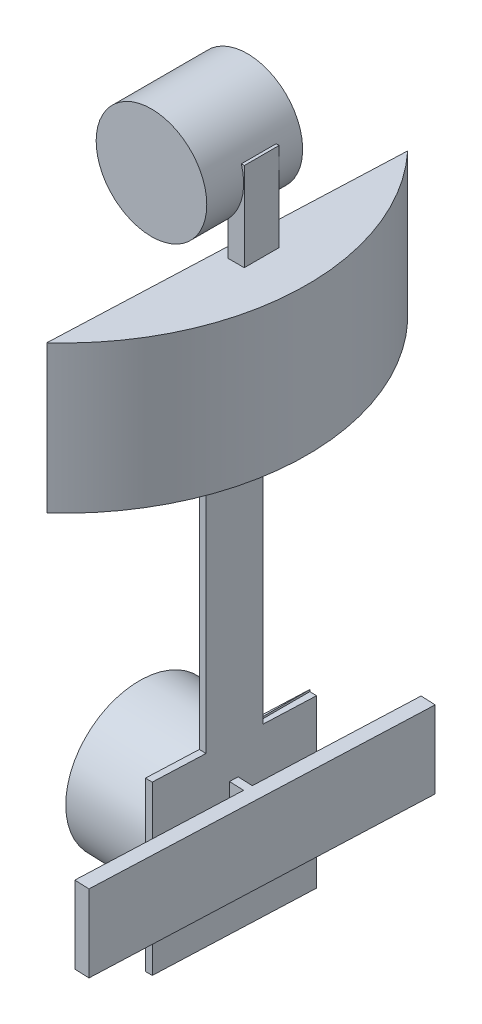
ISO-10303-21;
HEADER;
FILE_DESCRIPTION(('STEP AP214'),'2;1');
FILE_NAME('part.step','',(''),(''),'','','');
FILE_SCHEMA(('AUTOMOTIVE_DESIGN { 1 0 10303 214 1 1 1 1 }'));
ENDSEC;
DATA;
#1=APPLICATION_CONTEXT('core data for automotive mechanical design processes');
#2=APPLICATION_PROTOCOL_DEFINITION('international standard','automotive_design',2000,#1);
#3=PRODUCT_CONTEXT('',#1,'mechanical');
#4=PRODUCT('Part','Part','',(#3));
#5=PRODUCT_RELATED_PRODUCT_CATEGORY('part','',(#4));
#6=PRODUCT_DEFINITION_FORMATION('','',#4);
#7=PRODUCT_DEFINITION_CONTEXT('part definition',#1,'design');
#8=PRODUCT_DEFINITION('design','',#6,#7);
#9=PRODUCT_DEFINITION_SHAPE('','',#8);
#10=(LENGTH_UNIT() NAMED_UNIT(*) SI_UNIT(.MILLI.,.METRE.));
#11=(NAMED_UNIT(*) PLANE_ANGLE_UNIT() SI_UNIT($,.RADIAN.));
#12=(NAMED_UNIT(*) SI_UNIT($,.STERADIAN.) SOLID_ANGLE_UNIT());
#13=UNCERTAINTY_MEASURE_WITH_UNIT(LENGTH_MEASURE(1.E-05),#10,'distance_accuracy_value','');
#14=(GEOMETRIC_REPRESENTATION_CONTEXT(3) GLOBAL_UNCERTAINTY_ASSIGNED_CONTEXT((#13)) GLOBAL_UNIT_ASSIGNED_CONTEXT((#10,
#11,#12)) REPRESENTATION_CONTEXT('',''));
#15=CARTESIAN_POINT('',(0.,0.,0.));
#16=DIRECTION('',(0.,0.,1.));
#17=DIRECTION('',(1.,0.,0.));
#18=AXIS2_PLACEMENT_3D('',#15,#16,#17);
#19=CARTESIAN_POINT('',(24.5634594346817,32.,-2.47275001168789));
#20=DIRECTION('',(1.,0.,0.));
#21=DIRECTION('',(0.,0.,-1.));
#22=AXIS2_PLACEMENT_3D('',#19,#20,#21);
#23=PLANE('',#22);
#24=DIRECTION('',(0.,0.,1.));
#25=VECTOR('',#24,1.);
#26=CARTESIAN_POINT('',(24.5634594346817,24.6687580521327,-5.74712469354193));
#27=LINE('',#26,#25);
#28=CARTESIAN_POINT('',(24.5634594346817,24.6687580521327,-2.47275001168789));
#29=VERTEX_POINT('',#28);
#30=CARTESIAN_POINT('',(24.5634594346817,24.6687580521327,2.25287530645807));
#31=VERTEX_POINT('',#30);
#32=EDGE_CURVE('E219',#29,#31,#27,.T.);
#33=ORIENTED_EDGE('',*,*,#32,.F.);
#34=DIRECTION('',(0.,-1.,0.));
#35=VECTOR('',#34,1.);
#36=CARTESIAN_POINT('',(24.5634594346817,32.,-2.47275001168789));
#37=LINE('',#36,#35);
#38=CARTESIAN_POINT('',(24.5634594346817,20.,-2.47275001168789));
#39=VERTEX_POINT('',#38);
#40=EDGE_CURVE('E237',#29,#39,#37,.T.);
#41=ORIENTED_EDGE('',*,*,#40,.T.);
#42=DIRECTION('',(0.,0.,1.));
#43=VECTOR('',#42,1.);
#44=CARTESIAN_POINT('',(24.5634594346817,20.,-2.47275001168789));
#45=LINE('',#44,#43);
#46=CARTESIAN_POINT('',(24.5634594346817,20.,2.25287530645807));
#47=VERTEX_POINT('',#46);
#48=EDGE_CURVE('E238',#39,#47,#45,.T.);
#49=ORIENTED_EDGE('',*,*,#48,.T.);
#50=DIRECTION('',(0.,-1.,0.));
#51=VECTOR('',#50,1.);
#52=CARTESIAN_POINT('',(24.5634594346817,32.,2.25287530645807));
#53=LINE('',#52,#51);
#54=EDGE_CURVE('E247',#31,#47,#53,.T.);
#55=ORIENTED_EDGE('',*,*,#54,.F.);
#56=EDGE_LOOP('',(#33,#41,#49,#55));
#57=FACE_BOUND('',#56,.T.);
#58=ADVANCED_FACE('F34',(#57),#23,.F.);
#59=CARTESIAN_POINT('',(24.5634594346817,32.,-2.47275001168789));
#60=DIRECTION('',(0.,0.,1.));
#61=DIRECTION('',(1.,0.,0.));
#62=AXIS2_PLACEMENT_3D('',#59,#60,#61);
#63=PLANE('',#62);
#64=CARTESIAN_POINT('',(19.1506205338463,29.8602101643652,-2.47275001168789));
#65=DIRECTION('',(0.,0.,1.));
#66=DIRECTION('',(1.,0.,0.));
#67=AXIS2_PLACEMENT_3D('',#64,#65,#66);
#68=CIRCLE('',#67,7.5);
#69=CARTESIAN_POINT('',(26.3388956718272,32.,-2.47275001168789));
#70=VERTEX_POINT('',#69);
#71=EDGE_CURVE('E211',#70,#29,#68,.F.);
#72=ORIENTED_EDGE('',*,*,#71,.F.);
#73=DIRECTION('',(-1.,0.,0.));
#74=VECTOR('',#73,1.);
#75=CARTESIAN_POINT('',(24.5634594346817,32.,-2.47275001168789));
#76=LINE('',#75,#74);
#77=CARTESIAN_POINT('',(26.7372470810288,32.,-2.47275001168789));
#78=VERTEX_POINT('',#77);
#79=EDGE_CURVE('E208',#78,#70,#76,.T.);
#80=ORIENTED_EDGE('',*,*,#79,.F.);
#81=DIRECTION('',(0.,-1.,0.));
#82=VECTOR('',#81,1.);
#83=CARTESIAN_POINT('',(26.7372470810288,32.,-2.47275001168789));
#84=LINE('',#83,#82);
#85=CARTESIAN_POINT('',(26.7372470810288,20.,-2.47275001168789));
#86=VERTEX_POINT('',#85);
#87=EDGE_CURVE('E51',#78,#86,#84,.T.);
#88=ORIENTED_EDGE('',*,*,#87,.T.);
#89=DIRECTION('',(-1.,0.,0.));
#90=VECTOR('',#89,1.);
#91=CARTESIAN_POINT('',(24.5634594346817,20.,-2.47275001168789));
#92=LINE('',#91,#90);
#93=EDGE_CURVE('E229',#86,#39,#92,.T.);
#94=ORIENTED_EDGE('',*,*,#93,.T.);
#95=ORIENTED_EDGE('',*,*,#40,.F.);
#96=EDGE_LOOP('',(#72,#80,#88,#94,#95));
#97=FACE_BOUND('',#96,.T.);
#98=ADVANCED_FACE('F462',(#97),#63,.F.);
#99=CARTESIAN_POINT('',(0.,32.,0.));
#100=DIRECTION('',(0.,1.,0.));
#101=DIRECTION('',(0.,0.,1.));
#102=AXIS2_PLACEMENT_3D('',#99,#100,#101);
#103=PLANE('',#102);
#104=ORIENTED_EDGE('',*,*,#79,.T.);
#105=DIRECTION('',(0.,0.,1.));
#106=VECTOR('',#105,1.);
#107=CARTESIAN_POINT('',(26.3388956718272,32.,-5.74712469354193));
#108=LINE('',#107,#106);
#109=CARTESIAN_POINT('',(26.3388956718272,32.,2.25287530645807));
#110=VERTEX_POINT('',#109);
#111=EDGE_CURVE('E202',#70,#110,#108,.T.);
#112=ORIENTED_EDGE('',*,*,#111,.T.);
#113=DIRECTION('',(1.,0.,0.));
#114=VECTOR('',#113,1.);
#115=CARTESIAN_POINT('',(24.5634594346817,32.,2.25287530645807));
#116=LINE('',#115,#114);
#117=CARTESIAN_POINT('',(26.7372470810288,32.,2.25287530645807));
#118=VERTEX_POINT('',#117);
#119=EDGE_CURVE('E206',#110,#118,#116,.T.);
#120=ORIENTED_EDGE('',*,*,#119,.T.);
#121=DIRECTION('',(0.,0.,-1.));
#122=VECTOR('',#121,1.);
#123=CARTESIAN_POINT('',(26.7372470810288,32.,-2.47275001168789));
#124=LINE('',#123,#122);
#125=EDGE_CURVE('E228',#118,#78,#124,.T.);
#126=ORIENTED_EDGE('',*,*,#125,.T.);
#127=EDGE_LOOP('',(#104,#112,#120,#126));
#128=FACE_BOUND('',#127,.T.);
#129=ADVANCED_FACE('F204',(#128),#103,.T.);
#130=CARTESIAN_POINT('',(24.5634594346817,32.,2.25287530645807));
#131=DIRECTION('',(0.,0.,-1.));
#132=DIRECTION('',(-1.,0.,0.));
#133=AXIS2_PLACEMENT_3D('',#130,#131,#132);
#134=PLANE('',#133);
#135=CARTESIAN_POINT('',(19.1506205338463,29.8602101643652,2.25287530645807));
#136=DIRECTION('',(0.,0.,1.));
#137=DIRECTION('',(1.,0.,0.));
#138=AXIS2_PLACEMENT_3D('',#135,#136,#137);
#139=CIRCLE('',#138,7.5);
#140=EDGE_CURVE('E215',#31,#110,#139,.T.);
#141=ORIENTED_EDGE('',*,*,#140,.F.);
#142=ORIENTED_EDGE('',*,*,#54,.T.);
#143=DIRECTION('',(1.,0.,0.));
#144=VECTOR('',#143,1.);
#145=CARTESIAN_POINT('',(24.5634594346817,20.,2.25287530645807));
#146=LINE('',#145,#144);
#147=CARTESIAN_POINT('',(26.7372470810288,20.,2.25287530645807));
#148=VERTEX_POINT('',#147);
#149=EDGE_CURVE('E241',#47,#148,#146,.T.);
#150=ORIENTED_EDGE('',*,*,#149,.T.);
#151=DIRECTION('',(0.,-1.,0.));
#152=VECTOR('',#151,1.);
#153=CARTESIAN_POINT('',(26.7372470810288,32.,2.25287530645807));
#154=LINE('',#153,#152);
#155=EDGE_CURVE('E226',#118,#148,#154,.T.);
#156=ORIENTED_EDGE('',*,*,#155,.F.);
#157=ORIENTED_EDGE('',*,*,#119,.F.);
#158=EDGE_LOOP('',(#141,#142,#150,#156,#157));
#159=FACE_BOUND('',#158,.T.);
#160=ADVANCED_FACE('F224',(#159),#134,.F.);
#161=CARTESIAN_POINT('',(0.,20.,0.));
#162=DIRECTION('',(0.,1.,0.));
#163=DIRECTION('',(0.,0.,1.));
#164=AXIS2_PLACEMENT_3D('',#161,#162,#163);
#165=PLANE('',#164);
#166=CARTESIAN_POINT('',(0.,20.,0.));
#167=DIRECTION('',(0.,1.,0.));
#168=DIRECTION('',(0.,0.,1.));
#169=AXIS2_PLACEMENT_3D('',#166,#167,#168);
#170=CIRCLE('',#169,33.);
#171=CARTESIAN_POINT('',(22.1593035292646,20.,24.4533283439682));
#172=VERTEX_POINT('',#171);
#173=CARTESIAN_POINT('',(24.0966304124683,20.,-22.5466716560318));
#174=VERTEX_POINT('',#173);
#175=EDGE_CURVE('E384',#172,#174,#170,.T.);
#176=ORIENTED_EDGE('',*,*,#175,.T.);
#177=DIRECTION('',(-0.0411847479782541,0.,0.999151548331867));
#178=VECTOR('',#177,1.);
#179=CARTESIAN_POINT('',(24.0966304124683,20.,-22.5466716560318));
#180=LINE('',#179,#178);
#181=EDGE_CURVE('E387',#174,#172,#180,.T.);
#182=ORIENTED_EDGE('',*,*,#181,.T.);
#183=EDGE_LOOP('',(#176,#182));
#184=FACE_BOUND('',#183,.T.);
#185=ORIENTED_EDGE('',*,*,#149,.F.);
#186=ORIENTED_EDGE('',*,*,#48,.F.);
#187=ORIENTED_EDGE('',*,*,#93,.F.);
#188=DIRECTION('',(0.,0.,-1.));
#189=VECTOR('',#188,1.);
#190=CARTESIAN_POINT('',(26.7372470810288,20.,-2.47275001168789));
#191=LINE('',#190,#189);
#192=EDGE_CURVE('E232',#148,#86,#191,.T.);
#193=ORIENTED_EDGE('',*,*,#192,.F.);
#194=EDGE_LOOP('',(#185,#186,#187,#193));
#195=FACE_BOUND('',#194,.T.);
#196=ADVANCED_FACE('F471',(#184,#195),#165,.T.);
#197=CARTESIAN_POINT('',(0.,20.,0.));
#198=DIRECTION('',(0.,-1.,0.));
#199=DIRECTION('',(0.,0.,-1.));
#200=AXIS2_PLACEMENT_3D('',#197,#198,#199);
#201=CYLINDRICAL_SURFACE('',#200,33.);
#202=CARTESIAN_POINT('',(0.,0.,0.));
#203=DIRECTION('',(0.,1.,0.));
#204=DIRECTION('',(0.,0.,1.));
#205=AXIS2_PLACEMENT_3D('',#202,#203,#204);
#206=CIRCLE('',#205,33.);
#207=CARTESIAN_POINT('',(22.1593035292646,0.,24.4533283439682));
#208=VERTEX_POINT('',#207);
#209=CARTESIAN_POINT('',(24.0966304124683,0.,-22.5466716560318));
#210=VERTEX_POINT('',#209);
#211=EDGE_CURVE('E381',#208,#210,#206,.T.);
#212=ORIENTED_EDGE('',*,*,#211,.T.);
#213=DIRECTION('',(0.,-1.,0.));
#214=VECTOR('',#213,1.);
#215=CARTESIAN_POINT('',(24.0966304124683,20.,-22.5466716560318));
#216=LINE('',#215,#214);
#217=EDGE_CURVE('E44',#174,#210,#216,.T.);
#218=ORIENTED_EDGE('',*,*,#217,.F.);
#219=ORIENTED_EDGE('',*,*,#175,.F.);
#220=DIRECTION('',(0.,-1.,0.));
#221=VECTOR('',#220,1.);
#222=CARTESIAN_POINT('',(22.1593035292646,20.,24.4533283439682));
#223=LINE('',#222,#221);
#224=EDGE_CURVE('E389',#172,#208,#223,.T.);
#225=ORIENTED_EDGE('',*,*,#224,.T.);
#226=EDGE_LOOP('',(#212,#218,#219,#225));
#227=FACE_BOUND('',#226,.T.);
#228=ADVANCED_FACE('F36',(#227),#201,.T.);
#229=CARTESIAN_POINT('',(23.1279669708665,-60.,23.5392681235953));
#230=DIRECTION('',(0.999151548331867,0.,0.0411847479782541));
#231=DIRECTION('',(0.0411847479782541,0.,-0.999151548331867));
#232=AXIS2_PLACEMENT_3D('',#229,#230,#231);
#233=PLANE('',#232);
#234=DIRECTION('',(0.,1.,0.));
#235=VECTOR('',#234,1.);
#236=CARTESIAN_POINT('',(23.9078908041377,-37.2882001474011,4.61813484373992));
#237=LINE('',#236,#235);
#238=CARTESIAN_POINT('',(23.9078908041377,-37.2882001474011,4.61813484373992));
#239=VERTEX_POINT('',#238);
#240=CARTESIAN_POINT('',(23.9078908041377,0.,4.61813484373992));
#241=VERTEX_POINT('',#240);
#242=EDGE_CURVE('E254',#239,#241,#237,.T.);
#243=ORIENTED_EDGE('',*,*,#242,.F.);
#244=DIRECTION('',(0.0411847479782544,0.,-0.999151548331867));
#245=VECTOR('',#244,1.);
#246=CARTESIAN_POINT('',(23.6195975682899,-37.2882001474011,11.612195682063));
#247=LINE('',#246,#245);
#248=CARTESIAN_POINT('',(23.6195975682899,-37.2882001474011,11.612195682063));
#249=VERTEX_POINT('',#248);
#250=EDGE_CURVE('E251',#249,#239,#247,.T.);
#251=ORIENTED_EDGE('',*,*,#250,.F.);
#252=DIRECTION('',(0.,-1.,0.));
#253=VECTOR('',#252,1.);
#254=CARTESIAN_POINT('',(23.6195975682899,0.,11.612195682063));
#255=LINE('',#254,#253);
#256=CARTESIAN_POINT('',(23.6195975682899,-60.,11.612195682063));
#257=VERTEX_POINT('',#256);
#258=EDGE_CURVE('E309',#249,#257,#255,.T.);
#259=ORIENTED_EDGE('',*,*,#258,.T.);
#260=DIRECTION('',(0.041184747978254,0.,-0.999151548331867));
#261=VECTOR('',#260,1.);
#262=CARTESIAN_POINT('',(23.1279669708665,-60.,23.5392681235953));
#263=LINE('',#262,#261);
#264=CARTESIAN_POINT('',(24.5021130952118,-60.,-9.79783590576096));
#265=VERTEX_POINT('',#264);
#266=EDGE_CURVE('E379',#257,#265,#263,.T.);
#267=ORIENTED_EDGE('',*,*,#266,.T.);
#268=DIRECTION('',(0.,-1.,0.));
#269=VECTOR('',#268,1.);
#270=CARTESIAN_POINT('',(24.5021130952118,0.,-9.79783590576096));
#271=LINE('',#270,#269);
#272=CARTESIAN_POINT('',(24.5021130952118,-37.4015508551651,-9.79783590576096));
#273=VERTEX_POINT('',#272);
#274=EDGE_CURVE('E296',#273,#265,#271,.T.);
#275=ORIENTED_EDGE('',*,*,#274,.F.);
#276=DIRECTION('',(0.0411847479782541,0.,-0.999151548331867));
#277=VECTOR('',#276,1.);
#278=CARTESIAN_POINT('',(23.1279669708665,-37.4015508551651,23.5392681235953));
#279=LINE('',#278,#277);
#280=CARTESIAN_POINT('',(24.2135750487772,-37.4015508551651,-2.79783590576096));
#281=VERTEX_POINT('',#280);
#282=EDGE_CURVE('E288',#281,#273,#279,.T.);
#283=ORIENTED_EDGE('',*,*,#282,.F.);
#284=DIRECTION('',(0.,-1.,0.));
#285=VECTOR('',#284,1.);
#286=CARTESIAN_POINT('',(24.2135750487772,-60.,-2.79783590576096));
#287=LINE('',#286,#285);
#288=CARTESIAN_POINT('',(24.2135750487772,0.,-2.79783590576096));
#289=VERTEX_POINT('',#288);
#290=EDGE_CURVE('E290',#289,#281,#287,.T.);
#291=ORIENTED_EDGE('',*,*,#290,.F.);
#292=DIRECTION('',(0.041184747978254,0.,-0.999151548331867));
#293=VECTOR('',#292,1.);
#294=CARTESIAN_POINT('',(23.1279669708665,0.,23.5392681235953));
#295=LINE('',#294,#293);
#296=EDGE_CURVE('E38',#241,#289,#295,.T.);
#297=ORIENTED_EDGE('',*,*,#296,.F.);
#298=EDGE_LOOP('',(#243,#251,#259,#267,#275,#283,#291,#297));
#299=FACE_BOUND('',#298,.T.);
#300=DIRECTION('',(0.,1.,0.));
#301=VECTOR('',#300,1.);
#302=CARTESIAN_POINT('',(24.0807165375977,-42.0371881216656,0.425342422880257));
#303=LINE('',#302,#301);
#304=CARTESIAN_POINT('',(24.0807165375977,-52.4989150076841,0.425342422880257));
#305=VERTEX_POINT('',#304);
#306=CARTESIAN_POINT('',(24.0807165375977,-42.0371881216656,0.425342422880269));
#307=VERTEX_POINT('',#306);
#308=EDGE_CURVE('E313',#305,#307,#303,.T.);
#309=ORIENTED_EDGE('',*,*,#308,.F.);
#310=DIRECTION('',(0.041184747978254,0.,-0.999151548331867));
#311=VECTOR('',#310,1.);
#312=CARTESIAN_POINT('',(23.1279669708665,-52.4989150076841,23.5392681235953));
#313=LINE('',#312,#311);
#314=CARTESIAN_POINT('',(24.0340314263881,-52.4989150076841,1.55793406029422));
#315=VERTEX_POINT('',#314);
#316=EDGE_CURVE('E346',#315,#305,#313,.T.);
#317=ORIENTED_EDGE('',*,*,#316,.F.);
#318=DIRECTION('',(0.,-1.,0.));
#319=VECTOR('',#318,1.);
#320=CARTESIAN_POINT('',(24.0340314263881,-52.4989150076841,1.55793406029422));
#321=LINE('',#320,#319);
#322=CARTESIAN_POINT('',(24.0340314263881,-42.0371881216656,1.55793406029422));
#323=VERTEX_POINT('',#322);
#324=EDGE_CURVE('E331',#323,#315,#321,.T.);
#325=ORIENTED_EDGE('',*,*,#324,.F.);
#326=DIRECTION('',(-0.041184747978254,0.,0.999151548331867));
#327=VECTOR('',#326,1.);
#328=CARTESIAN_POINT('',(23.1279669708665,-42.0371881216656,23.5392681235953));
#329=LINE('',#328,#327);
#330=EDGE_CURVE('E352',#307,#323,#329,.T.);
#331=ORIENTED_EDGE('',*,*,#330,.F.);
#332=EDGE_LOOP('',(#309,#317,#325,#331));
#333=FACE_BOUND('',#332,.T.);
#334=ADVANCED_FACE('F414',(#299,#333),#233,.T.);
#335=CARTESIAN_POINT('',(24.0966304124683,20.,-22.5466716560318));
#336=DIRECTION('',(0.999151548331867,0.,0.0411847479782541));
#337=DIRECTION('',(0.0411847479782541,0.,-0.999151548331867));
#338=AXIS2_PLACEMENT_3D('',#335,#336,#337);
#339=PLANE('',#338);
#340=DIRECTION('',(0.,1.,0.));
#341=VECTOR('',#340,1.);
#342=CARTESIAN_POINT('',(22.9784837930112,20.,4.57982494612092));
#343=LINE('',#342,#341);
#344=CARTESIAN_POINT('',(22.9784837930112,-37.2882001474011,4.57982494612092));
#345=VERTEX_POINT('',#344);
#346=CARTESIAN_POINT('',(22.9784837930112,0.,4.57982494612092));
#347=VERTEX_POINT('',#346);
#348=EDGE_CURVE('E262',#345,#347,#343,.T.);
#349=ORIENTED_EDGE('',*,*,#348,.T.);
#350=DIRECTION('',(0.0411847479782541,0.,-0.999151548331867));
#351=VECTOR('',#350,1.);
#352=CARTESIAN_POINT('',(22.1593035292646,0.,24.4533283439682));
#353=LINE('',#352,#351);
#354=EDGE_CURVE('E304',#208,#347,#353,.T.);
#355=ORIENTED_EDGE('',*,*,#354,.F.);
#356=ORIENTED_EDGE('',*,*,#224,.F.);
#357=ORIENTED_EDGE('',*,*,#181,.F.);
#358=ORIENTED_EDGE('',*,*,#217,.T.);
#359=DIRECTION('',(0.0411847479782535,0.,-0.999151548331867));
#360=VECTOR('',#359,1.);
#361=CARTESIAN_POINT('',(23.5711269607971,0.,-9.79783590576096));
#362=LINE('',#361,#360);
#363=CARTESIAN_POINT('',(23.2825889143625,0.,-2.79783590576096));
#364=VERTEX_POINT('',#363);
#365=EDGE_CURVE('E293',#364,#210,#362,.T.);
#366=ORIENTED_EDGE('',*,*,#365,.F.);
#367=DIRECTION('',(0.,-1.,0.));
#368=VECTOR('',#367,1.);
#369=CARTESIAN_POINT('',(23.2825889143625,20.,-2.79783590576096));
#370=LINE('',#369,#368);
#371=CARTESIAN_POINT('',(23.2825889143625,-37.1430967127821,-2.79783590576096));
#372=VERTEX_POINT('',#371);
#373=EDGE_CURVE('E271',#364,#372,#370,.T.);
#374=ORIENTED_EDGE('',*,*,#373,.T.);
#375=DIRECTION('',(0.0411847479782541,0.,-0.999151548331867));
#376=VECTOR('',#375,1.);
#377=CARTESIAN_POINT('',(24.0966304124683,-37.1430967127821,-22.5466716560318));
#378=LINE('',#377,#376);
#379=CARTESIAN_POINT('',(23.5711269607971,-37.1430967127821,-9.79783590576096));
#380=VERTEX_POINT('',#379);
#381=EDGE_CURVE('E268',#372,#380,#378,.T.);
#382=ORIENTED_EDGE('',*,*,#381,.T.);
#383=DIRECTION('',(0.,-1.,0.));
#384=VECTOR('',#383,1.);
#385=CARTESIAN_POINT('',(23.5711269607971,0.,-9.79783590576096));
#386=LINE('',#385,#384);
#387=CARTESIAN_POINT('',(23.5711269607971,-37.4015508551651,-9.79783590576096));
#388=VERTEX_POINT('',#387);
#389=EDGE_CURVE('E299',#380,#388,#386,.T.);
#390=ORIENTED_EDGE('',*,*,#389,.T.);
#391=CARTESIAN_POINT('',(23.5711269607971,-60.,-9.79783590576096));
#392=VERTEX_POINT('',#391);
#393=EDGE_CURVE('E302',#388,#392,#386,.T.);
#394=ORIENTED_EDGE('',*,*,#393,.T.);
#395=DIRECTION('',(0.0411847479782541,0.,-0.999151548331867));
#396=VECTOR('',#395,1.);
#397=CARTESIAN_POINT('',(22.1593035292646,-60.,24.4533283439682));
#398=LINE('',#397,#396);
#399=CARTESIAN_POINT('',(22.6886114338751,-60.,11.612195682063));
#400=VERTEX_POINT('',#399);
#401=EDGE_CURVE('E376',#400,#392,#398,.T.);
#402=ORIENTED_EDGE('',*,*,#401,.F.);
#403=DIRECTION('',(0.,-1.,0.));
#404=VECTOR('',#403,1.);
#405=CARTESIAN_POINT('',(22.6886114338751,0.,11.612195682063));
#406=LINE('',#405,#404);
#407=CARTESIAN_POINT('',(22.6886114338751,-37.2882001474011,11.612195682063));
#408=VERTEX_POINT('',#407);
#409=EDGE_CURVE('E306',#408,#400,#406,.T.);
#410=ORIENTED_EDGE('',*,*,#409,.F.);
#411=DIRECTION('',(0.0411847479782541,0.,-0.999151548331867));
#412=VECTOR('',#411,1.);
#413=CARTESIAN_POINT('',(24.0966304124683,-37.2882001474011,-22.5466716560318));
#414=LINE('',#413,#412);
#415=EDGE_CURVE('E59',#408,#345,#414,.T.);
#416=ORIENTED_EDGE('',*,*,#415,.T.);
#417=EDGE_LOOP('',(#349,#355,#356,#357,#358,#366,#374,#382,#390,#394,#402,#410,#416));
#418=FACE_BOUND('',#417,.T.);
#419=CARTESIAN_POINT('',(23.1279669708665,-47.,0.953328343968238));
#420=DIRECTION('',(0.999151548331867,0.,0.0411847479782541));
#421=DIRECTION('',(0.0411847479782541,0.,-0.999151548331867));
#422=AXIS2_PLACEMENT_3D('',#419,#420,#421);
#423=CIRCLE('',#422,10.);
#424=CARTESIAN_POINT('',(23.539814450649,-47.,-9.03818713935044));
#425=VERTEX_POINT('',#424);
#426=EDGE_CURVE('E11',#425,#425,#423,.F.);
#427=ORIENTED_EDGE('',*,*,#426,.F.);
#428=EDGE_LOOP('',(#427));
#429=FACE_BOUND('',#428,.T.);
#430=ADVANCED_FACE('F401',(#418,#429),#339,.F.);
#431=CARTESIAN_POINT('',(0.,0.,0.));
#432=DIRECTION('',(0.,1.,0.));
#433=DIRECTION('',(0.,0.,1.));
#434=AXIS2_PLACEMENT_3D('',#431,#432,#433);
#435=PLANE('',#434);
#436=ORIENTED_EDGE('',*,*,#354,.T.);
#437=DIRECTION('',(0.999151548331867,0.,0.0411847479782541));
#438=VECTOR('',#437,1.);
#439=CARTESIAN_POINT('',(16.9138299658146,0.,4.32984160789214));
#440=LINE('',#439,#438);
#441=EDGE_CURVE('E258',#347,#241,#440,.T.);
#442=ORIENTED_EDGE('',*,*,#441,.T.);
#443=ORIENTED_EDGE('',*,*,#296,.T.);
#444=DIRECTION('',(1.,0.,0.));
#445=VECTOR('',#444,1.);
#446=CARTESIAN_POINT('',(23.5711269607971,0.,-2.79783590576096));
#447=LINE('',#446,#445);
#448=EDGE_CURVE('E278',#364,#289,#447,.T.);
#449=ORIENTED_EDGE('',*,*,#448,.F.);
#450=ORIENTED_EDGE('',*,*,#365,.T.);
#451=ORIENTED_EDGE('',*,*,#211,.F.);
#452=EDGE_LOOP('',(#436,#442,#443,#449,#450,#451));
#453=FACE_BOUND('',#452,.T.);
#454=ADVANCED_FACE('F406',(#453),#435,.F.);
#455=CARTESIAN_POINT('',(0.,-60.,0.));
#456=DIRECTION('',(0.,-1.,0.));
#457=DIRECTION('',(0.,0.,-1.));
#458=AXIS2_PLACEMENT_3D('',#455,#456,#457);
#459=PLANE('',#458);
#460=DIRECTION('',(-1.,0.,0.));
#461=VECTOR('',#460,1.);
#462=CARTESIAN_POINT('',(23.5711269607971,-60.,-9.79783590576096));
#463=LINE('',#462,#461);
#464=EDGE_CURVE('E292',#265,#392,#463,.T.);
#465=ORIENTED_EDGE('',*,*,#464,.F.);
#466=ORIENTED_EDGE('',*,*,#266,.F.);
#467=DIRECTION('',(1.,0.,0.));
#468=VECTOR('',#467,1.);
#469=CARTESIAN_POINT('',(22.6886114338751,-60.,11.612195682063));
#470=LINE('',#469,#468);
#471=EDGE_CURVE('E301',#400,#257,#470,.T.);
#472=ORIENTED_EDGE('',*,*,#471,.F.);
#473=ORIENTED_EDGE('',*,*,#401,.T.);
#474=EDGE_LOOP('',(#465,#466,#472,#473));
#475=FACE_BOUND('',#474,.T.);
#476=ADVANCED_FACE('F441',(#475),#459,.T.);
#477=CARTESIAN_POINT('',(11.1381483908841,-47.,0.45911136822919));
#478=DIRECTION('',(0.999151548331867,0.,0.0411847479782541));
#479=DIRECTION('',(0.0411847479782541,0.,-0.999151548331867));
#480=AXIS2_PLACEMENT_3D('',#477,#478,#479);
#481=CYLINDRICAL_SURFACE('',#480,10.);
#482=CARTESIAN_POINT('',(11.1381483908841,-47.,0.45911136822919));
#483=DIRECTION('',(-0.999151548331867,0.,-0.0411847479782541));
#484=DIRECTION('',(-0.0411847479782541,0.,0.999151548331867));
#485=AXIS2_PLACEMENT_3D('',#482,#483,#484);
#486=CIRCLE('',#485,10.);
#487=CARTESIAN_POINT('',(10.7263009111015,-47.,10.4506268515479));
#488=VERTEX_POINT('',#487);
#489=EDGE_CURVE('E373',#488,#488,#486,.T.);
#490=ORIENTED_EDGE('',*,*,#489,.F.);
#491=EDGE_LOOP('',(#490));
#492=FACE_BOUND('',#491,.T.);
#493=ORIENTED_EDGE('',*,*,#426,.T.);
#494=EDGE_LOOP('',(#493));
#495=FACE_BOUND('',#494,.T.);
#496=ADVANCED_FACE('F538',(#492,#495),#481,.T.);
#497=CARTESIAN_POINT('',(11.1381483908841,-47.,0.45911136822919));
#498=DIRECTION('',(-0.999151548331867,0.,-0.0411847479782541));
#499=DIRECTION('',(-0.0411847479782541,0.,0.999151548331867));
#500=AXIS2_PLACEMENT_3D('',#497,#498,#499);
#501=PLANE('',#500);
#502=ORIENTED_EDGE('',*,*,#489,.T.);
#503=EDGE_LOOP('',(#502));
#504=FACE_BOUND('',#503,.T.);
#505=ADVANCED_FACE('F727',(#504),#501,.T.);
#506=CARTESIAN_POINT('',(27.124573164194,-42.0371881216656,23.7040071155083));
#507=DIRECTION('',(0.0411847479782541,0.,-0.999151548331867));
#508=DIRECTION('',(-0.999151548331867,0.,-0.0411847479782541));
#509=AXIS2_PLACEMENT_3D('',#506,#507,#508);
#510=PLANE('',#509);
#511=DIRECTION('',(-0.999151548331867,0.,-0.0411847479782541));
#512=VECTOR('',#511,1.);
#513=CARTESIAN_POINT('',(27.124573164194,-42.0371881216656,23.7040071155083));
#514=LINE('',#513,#512);
#515=CARTESIAN_POINT('',(27.124573164194,-42.0371881216656,23.7040071155083));
#516=VERTEX_POINT('',#515);
#517=CARTESIAN_POINT('',(25.1262700675302,-42.0371881216656,23.6216376195518));
#518=VERTEX_POINT('',#517);
#519=EDGE_CURVE('E358',#516,#518,#514,.T.);
#520=ORIENTED_EDGE('',*,*,#519,.T.);
#521=DIRECTION('',(0.,1.,0.));
#522=VECTOR('',#521,1.);
#523=CARTESIAN_POINT('',(25.1262700675302,-52.4989150076841,23.6216376195518));
#524=LINE('',#523,#522);
#525=CARTESIAN_POINT('',(25.1262700675302,-52.4989150076841,23.6216376195518));
#526=VERTEX_POINT('',#525);
#527=EDGE_CURVE('E329',#526,#518,#524,.T.);
#528=ORIENTED_EDGE('',*,*,#527,.F.);
#529=DIRECTION('',(-0.999151548331867,0.,-0.0411847479782541));
#530=VECTOR('',#529,1.);
#531=CARTESIAN_POINT('',(27.124573164194,-52.4989150076841,23.7040071155083));
#532=LINE('',#531,#530);
#533=CARTESIAN_POINT('',(27.124573164194,-52.4989150076841,23.7040071155083));
#534=VERTEX_POINT('',#533);
#535=EDGE_CURVE('E370',#534,#526,#532,.T.);
#536=ORIENTED_EDGE('',*,*,#535,.F.);
#537=DIRECTION('',(0.,-1.,0.));
#538=VECTOR('',#537,1.);
#539=CARTESIAN_POINT('',(27.124573164194,-42.0371881216656,23.7040071155083));
#540=LINE('',#539,#538);
#541=EDGE_CURVE('E348',#516,#534,#540,.T.);
#542=ORIENTED_EDGE('',*,*,#541,.F.);
#543=EDGE_LOOP('',(#520,#528,#536,#542));
#544=FACE_BOUND('',#543,.T.);
#545=ADVANCED_FACE('F680',(#544),#510,.F.);
#546=CARTESIAN_POINT('',(27.124573164194,-52.4989150076841,23.7040071155083));
#547=DIRECTION('',(0.,1.,0.));
#548=DIRECTION('',(0.,0.,1.));
#549=AXIS2_PLACEMENT_3D('',#546,#547,#548);
#550=PLANE('',#549);
#551=DIRECTION('',(-0.999151548331867,0.,-0.0411847479782555));
#552=VECTOR('',#551,1.);
#553=CARTESIAN_POINT('',(24.0807165375977,-52.4989150076841,0.425342422880257));
#554=LINE('',#553,#552);
#555=CARTESIAN_POINT('',(26.0790196342615,-52.4989150076841,0.507711918836768));
#556=VERTEX_POINT('',#555);
#557=EDGE_CURVE('E321',#556,#305,#554,.T.);
#558=ORIENTED_EDGE('',*,*,#557,.F.);
#559=DIRECTION('',(0.0411847479782541,0.,-0.999151548331867));
#560=VECTOR('',#559,1.);
#561=CARTESIAN_POINT('',(26.0790196342615,-52.4989150076841,0.507711918836768));
#562=LINE('',#561,#560);
#563=CARTESIAN_POINT('',(26.9850840897831,-52.4989150076841,-21.4736221444643));
#564=VERTEX_POINT('',#563);
#565=EDGE_CURVE('E326',#556,#564,#562,.T.);
#566=ORIENTED_EDGE('',*,*,#565,.T.);
#567=DIRECTION('',(-0.999151548331867,0.,-0.0411847479782541));
#568=VECTOR('',#567,1.);
#569=CARTESIAN_POINT('',(28.9833871864468,-52.4989150076841,-21.3912526485078));
#570=LINE('',#569,#568);
#571=CARTESIAN_POINT('',(28.9833871864468,-52.4989150076841,-21.3912526485078));
#572=VERTEX_POINT('',#571);
#573=EDGE_CURVE('E367',#572,#564,#570,.T.);
#574=ORIENTED_EDGE('',*,*,#573,.F.);
#575=DIRECTION('',(0.041184747978254,0.,-0.999151548331867));
#576=VECTOR('',#575,1.);
#577=CARTESIAN_POINT('',(27.124573164194,-52.4989150076841,23.7040071155083));
#578=LINE('',#577,#576);
#579=EDGE_CURVE('E351',#534,#572,#578,.T.);
#580=ORIENTED_EDGE('',*,*,#579,.F.);
#581=ORIENTED_EDGE('',*,*,#535,.T.);
#582=DIRECTION('',(-0.0411847479782541,0.,0.999151548331867));
#583=VECTOR('',#582,1.);
#584=CARTESIAN_POINT('',(26.0323345230518,-52.4989150076841,1.64030355625073));
#585=LINE('',#584,#583);
#586=CARTESIAN_POINT('',(26.0323345230518,-52.4989150076841,1.64030355625073));
#587=VERTEX_POINT('',#586);
#588=EDGE_CURVE('E341',#587,#526,#585,.T.);
#589=ORIENTED_EDGE('',*,*,#588,.F.);
#590=DIRECTION('',(0.999151548331867,0.,0.0411847479782536));
#591=VECTOR('',#590,1.);
#592=CARTESIAN_POINT('',(24.0340314263881,-52.4989150076841,1.55793406029422));
#593=LINE('',#592,#591);
#594=EDGE_CURVE('E333',#315,#587,#593,.T.);
#595=ORIENTED_EDGE('',*,*,#594,.F.);
#596=ORIENTED_EDGE('',*,*,#316,.T.);
#597=EDGE_LOOP('',(#558,#566,#574,#580,#581,#589,#595,#596));
#598=FACE_BOUND('',#597,.T.);
#599=ADVANCED_FACE('F674',(#598),#550,.F.);
#600=CARTESIAN_POINT('',(28.9833871864468,-42.0371881216656,-21.3912526485078));
#601=DIRECTION('',(-0.0411847479782541,0.,0.999151548331867));
#602=DIRECTION('',(0.999151548331867,0.,0.0411847479782541));
#603=AXIS2_PLACEMENT_3D('',#600,#601,#602);
#604=PLANE('',#603);
#605=ORIENTED_EDGE('',*,*,#573,.T.);
#606=DIRECTION('',(0.,-1.,0.));
#607=VECTOR('',#606,1.);
#608=CARTESIAN_POINT('',(26.9850840897831,-42.0371881216656,-21.4736221444643));
#609=LINE('',#608,#607);
#610=CARTESIAN_POINT('',(26.9850840897831,-42.0371881216656,-21.4736221444643));
#611=VERTEX_POINT('',#610);
#612=EDGE_CURVE('E311',#611,#564,#609,.T.);
#613=ORIENTED_EDGE('',*,*,#612,.F.);
#614=DIRECTION('',(-0.999151548331867,0.,-0.0411847479782541));
#615=VECTOR('',#614,1.);
#616=CARTESIAN_POINT('',(28.9833871864468,-42.0371881216656,-21.3912526485078));
#617=LINE('',#616,#615);
#618=CARTESIAN_POINT('',(28.9833871864468,-42.0371881216656,-21.3912526485078));
#619=VERTEX_POINT('',#618);
#620=EDGE_CURVE('E364',#619,#611,#617,.T.);
#621=ORIENTED_EDGE('',*,*,#620,.F.);
#622=DIRECTION('',(0.,1.,0.));
#623=VECTOR('',#622,1.);
#624=CARTESIAN_POINT('',(28.9833871864468,-42.0371881216656,-21.3912526485078));
#625=LINE('',#624,#623);
#626=EDGE_CURVE('E354',#572,#619,#625,.T.);
#627=ORIENTED_EDGE('',*,*,#626,.F.);
#628=EDGE_LOOP('',(#605,#613,#621,#627));
#629=FACE_BOUND('',#628,.T.);
#630=ADVANCED_FACE('F679',(#629),#604,.F.);
#631=CARTESIAN_POINT('',(27.124573164194,-42.0371881216656,23.7040071155083));
#632=DIRECTION('',(0.,-1.,0.));
#633=DIRECTION('',(0.,0.,-1.));
#634=AXIS2_PLACEMENT_3D('',#631,#632,#633);
#635=PLANE('',#634);
#636=ORIENTED_EDGE('',*,*,#620,.T.);
#637=DIRECTION('',(0.0411847479782541,0.,-0.999151548331867));
#638=VECTOR('',#637,1.);
#639=CARTESIAN_POINT('',(26.0790196342615,-42.0371881216656,0.507711918836768));
#640=LINE('',#639,#638);
#641=CARTESIAN_POINT('',(26.0790196342615,-42.0371881216656,0.507711918836768));
#642=VERTEX_POINT('',#641);
#643=EDGE_CURVE('E324',#642,#611,#640,.T.);
#644=ORIENTED_EDGE('',*,*,#643,.F.);
#645=DIRECTION('',(0.999151548331867,0.,0.0411847479782554));
#646=VECTOR('',#645,1.);
#647=CARTESIAN_POINT('',(24.0807165375977,-42.0371881216656,0.425342422880257));
#648=LINE('',#647,#646);
#649=EDGE_CURVE('E315',#307,#642,#648,.T.);
#650=ORIENTED_EDGE('',*,*,#649,.F.);
#651=ORIENTED_EDGE('',*,*,#330,.T.);
#652=DIRECTION('',(-0.999151548331867,0.,-0.0411847479782536));
#653=VECTOR('',#652,1.);
#654=CARTESIAN_POINT('',(24.0340314263881,-42.0371881216656,1.55793406029422));
#655=LINE('',#654,#653);
#656=CARTESIAN_POINT('',(26.0323345230518,-42.0371881216656,1.64030355625074));
#657=VERTEX_POINT('',#656);
#658=EDGE_CURVE('E338',#657,#323,#655,.T.);
#659=ORIENTED_EDGE('',*,*,#658,.F.);
#660=DIRECTION('',(-0.0411847479782541,0.,0.999151548331867));
#661=VECTOR('',#660,1.);
#662=CARTESIAN_POINT('',(26.0323345230518,-42.0371881216656,1.64030355625073));
#663=LINE('',#662,#661);
#664=EDGE_CURVE('E343',#657,#518,#663,.T.);
#665=ORIENTED_EDGE('',*,*,#664,.T.);
#666=ORIENTED_EDGE('',*,*,#519,.F.);
#667=DIRECTION('',(-0.041184747978254,0.,0.999151548331867));
#668=VECTOR('',#667,1.);
#669=CARTESIAN_POINT('',(27.124573164194,-42.0371881216656,23.7040071155083));
#670=LINE('',#669,#668);
#671=EDGE_CURVE('E356',#619,#516,#670,.T.);
#672=ORIENTED_EDGE('',*,*,#671,.F.);
#673=EDGE_LOOP('',(#636,#644,#650,#651,#659,#665,#666,#672));
#674=FACE_BOUND('',#673,.T.);
#675=ADVANCED_FACE('F692',(#674),#635,.F.);
#676=CARTESIAN_POINT('',(28.0539801753204,0.,1.15637723350026));
#677=DIRECTION('',(0.999151548331867,0.,0.041184747978254));
#678=DIRECTION('',(0.041184747978254,0.,-0.999151548331867));
#679=AXIS2_PLACEMENT_3D('',#676,#677,#678);
#680=PLANE('',#679);
#681=ORIENTED_EDGE('',*,*,#541,.T.);
#682=ORIENTED_EDGE('',*,*,#579,.T.);
#683=ORIENTED_EDGE('',*,*,#626,.T.);
#684=ORIENTED_EDGE('',*,*,#671,.T.);
#685=EDGE_LOOP('',(#681,#682,#683,#684));
#686=FACE_BOUND('',#685,.T.);
#687=ADVANCED_FACE('F701',(#686),#680,.T.);
#688=CARTESIAN_POINT('',(26.0323345230518,-52.4989150076841,1.64030355625073));
#689=DIRECTION('',(0.999151548331867,0.,0.0411847479782541));
#690=DIRECTION('',(0.0411847479782541,0.,-0.999151548331867));
#691=AXIS2_PLACEMENT_3D('',#688,#689,#690);
#692=PLANE('',#691);
#693=ORIENTED_EDGE('',*,*,#527,.T.);
#694=ORIENTED_EDGE('',*,*,#664,.F.);
#695=DIRECTION('',(0.,1.,0.));
#696=VECTOR('',#695,1.);
#697=CARTESIAN_POINT('',(26.0323345230518,-52.4989150076841,1.64030355625073));
#698=LINE('',#697,#696);
#699=EDGE_CURVE('E336',#587,#657,#698,.T.);
#700=ORIENTED_EDGE('',*,*,#699,.F.);
#701=ORIENTED_EDGE('',*,*,#588,.T.);
#702=EDGE_LOOP('',(#693,#694,#700,#701));
#703=FACE_BOUND('',#702,.T.);
#704=ADVANCED_FACE('F738',(#703),#692,.F.);
#705=CARTESIAN_POINT('',(-0.0233425556048161,0.,0.566295818706999));
#706=DIRECTION('',(0.0411847479782536,0.,-0.999151548331867));
#707=DIRECTION('',(-0.999151548331867,0.,-0.0411847479782536));
#708=AXIS2_PLACEMENT_3D('',#705,#706,#707);
#709=PLANE('',#708);
#710=ORIENTED_EDGE('',*,*,#324,.T.);
#711=ORIENTED_EDGE('',*,*,#594,.T.);
#712=ORIENTED_EDGE('',*,*,#699,.T.);
#713=ORIENTED_EDGE('',*,*,#658,.T.);
#714=EDGE_LOOP('',(#710,#711,#712,#713));
#715=FACE_BOUND('',#714,.T.);
#716=ADVANCED_FACE('F717',(#715),#709,.F.);
#717=CARTESIAN_POINT('',(26.0790196342615,-42.0371881216656,0.507711918836768));
#718=DIRECTION('',(0.999151548331867,0.,0.0411847479782541));
#719=DIRECTION('',(0.0411847479782541,0.,-0.999151548331867));
#720=AXIS2_PLACEMENT_3D('',#717,#718,#719);
#721=PLANE('',#720);
#722=ORIENTED_EDGE('',*,*,#612,.T.);
#723=ORIENTED_EDGE('',*,*,#565,.F.);
#724=DIRECTION('',(0.,-1.,0.));
#725=VECTOR('',#724,1.);
#726=CARTESIAN_POINT('',(26.0790196342615,-42.0371881216656,0.507711918836768));
#727=LINE('',#726,#725);
#728=EDGE_CURVE('E318',#642,#556,#727,.T.);
#729=ORIENTED_EDGE('',*,*,#728,.F.);
#730=ORIENTED_EDGE('',*,*,#643,.T.);
#731=EDGE_LOOP('',(#722,#723,#729,#730));
#732=FACE_BOUND('',#731,.T.);
#733=ADVANCED_FACE('F710',(#732),#721,.F.);
#734=CARTESIAN_POINT('',(0.023342555604861,0.,-0.566295818707017));
#735=DIRECTION('',(-0.0411847479782555,0.,0.999151548331867));
#736=DIRECTION('',(0.999151548331867,0.,0.0411847479782555));
#737=AXIS2_PLACEMENT_3D('',#734,#735,#736);
#738=PLANE('',#737);
#739=ORIENTED_EDGE('',*,*,#308,.T.);
#740=ORIENTED_EDGE('',*,*,#649,.T.);
#741=ORIENTED_EDGE('',*,*,#728,.T.);
#742=ORIENTED_EDGE('',*,*,#557,.T.);
#743=EDGE_LOOP('',(#739,#740,#741,#742));
#744=FACE_BOUND('',#743,.T.);
#745=ADVANCED_FACE('F529',(#744),#738,.F.);
#746=CARTESIAN_POINT('',(22.6886114338751,0.,11.612195682063));
#747=DIRECTION('',(0.,0.,-1.));
#748=DIRECTION('',(-1.,0.,0.));
#749=AXIS2_PLACEMENT_3D('',#746,#747,#748);
#750=PLANE('',#749);
#751=ORIENTED_EDGE('',*,*,#258,.F.);
#752=DIRECTION('',(1.,0.,0.));
#753=VECTOR('',#752,1.);
#754=CARTESIAN_POINT('',(22.6886114338751,-37.2882001474011,11.612195682063));
#755=LINE('',#754,#753);
#756=EDGE_CURVE('E249',#408,#249,#755,.T.);
#757=ORIENTED_EDGE('',*,*,#756,.F.);
#758=ORIENTED_EDGE('',*,*,#409,.T.);
#759=ORIENTED_EDGE('',*,*,#471,.T.);
#760=EDGE_LOOP('',(#751,#757,#758,#759));
#761=FACE_BOUND('',#760,.T.);
#762=ADVANCED_FACE('F445',(#761),#750,.F.);
#763=CARTESIAN_POINT('',(23.5711269607971,0.,-9.79783590576096));
#764=DIRECTION('',(0.,0.,1.));
#765=DIRECTION('',(1.,0.,0.));
#766=AXIS2_PLACEMENT_3D('',#763,#764,#765);
#767=PLANE('',#766);
#768=ORIENTED_EDGE('',*,*,#393,.F.);
#769=DIRECTION('',(-1.,0.,0.));
#770=VECTOR('',#769,1.);
#771=CARTESIAN_POINT('',(23.5711269607971,-37.4015508551651,-9.79783590576096));
#772=LINE('',#771,#770);
#773=EDGE_CURVE('E274',#273,#388,#772,.T.);
#774=ORIENTED_EDGE('',*,*,#773,.F.);
#775=ORIENTED_EDGE('',*,*,#274,.T.);
#776=ORIENTED_EDGE('',*,*,#464,.T.);
#777=EDGE_LOOP('',(#768,#774,#775,#776));
#778=FACE_BOUND('',#777,.T.);
#779=ADVANCED_FACE('F436',(#778),#767,.F.);
#780=CARTESIAN_POINT('',(23.5711269607971,0.,-2.79783590576096));
#781=DIRECTION('',(-1.,0.,0.));
#782=DIRECTION('',(0.,0.,1.));
#783=AXIS2_PLACEMENT_3D('',#780,#781,#782);
#784=PLANE('',#783);
#785=ORIENTED_EDGE('',*,*,#389,.F.);
#786=DIRECTION('',(0.,0.,-1.));
#787=VECTOR('',#786,1.);
#788=CARTESIAN_POINT('',(23.5711269607971,-37.1430967127821,-2.79783590576096));
#789=LINE('',#788,#787);
#790=CARTESIAN_POINT('',(23.5711269607971,-37.1430967127821,-2.79783590576096));
#791=VERTEX_POINT('',#790);
#792=EDGE_CURVE('E264',#791,#380,#789,.T.);
#793=ORIENTED_EDGE('',*,*,#792,.F.);
#794=DIRECTION('',(0.,1.,0.));
#795=VECTOR('',#794,1.);
#796=CARTESIAN_POINT('',(23.5711269607971,0.,-2.79783590576096));
#797=LINE('',#796,#795);
#798=CARTESIAN_POINT('',(23.5711269607971,-37.4015508551651,-2.79783590576096));
#799=VERTEX_POINT('',#798);
#800=EDGE_CURVE('E275',#799,#791,#797,.T.);
#801=ORIENTED_EDGE('',*,*,#800,.F.);
#802=DIRECTION('',(0.,0.,-1.));
#803=VECTOR('',#802,1.);
#804=CARTESIAN_POINT('',(23.5711269607971,-37.4015508551651,-2.79783590576096));
#805=LINE('',#804,#803);
#806=EDGE_CURVE('E283',#799,#388,#805,.T.);
#807=ORIENTED_EDGE('',*,*,#806,.T.);
#808=EDGE_LOOP('',(#785,#793,#801,#807));
#809=FACE_BOUND('',#808,.T.);
#810=ADVANCED_FACE('F427',(#809),#784,.F.);
#811=CARTESIAN_POINT('',(23.5711269607971,-37.4015508551651,-2.79783590576096));
#812=DIRECTION('',(0.,-1.,0.));
#813=DIRECTION('',(0.,0.,-1.));
#814=AXIS2_PLACEMENT_3D('',#811,#812,#813);
#815=PLANE('',#814);
#816=ORIENTED_EDGE('',*,*,#282,.T.);
#817=ORIENTED_EDGE('',*,*,#773,.T.);
#818=ORIENTED_EDGE('',*,*,#806,.F.);
#819=DIRECTION('',(-1.,0.,0.));
#820=VECTOR('',#819,1.);
#821=CARTESIAN_POINT('',(23.5711269607971,-37.4015508551651,-2.79783590576096));
#822=LINE('',#821,#820);
#823=EDGE_CURVE('E281',#281,#799,#822,.T.);
#824=ORIENTED_EDGE('',*,*,#823,.F.);
#825=EDGE_LOOP('',(#816,#817,#818,#824));
#826=FACE_BOUND('',#825,.T.);
#827=ADVANCED_FACE('F433',(#826),#815,.F.);
#828=CARTESIAN_POINT('',(0.,0.,-2.79783590576101));
#829=DIRECTION('',(0.,0.,1.));
#830=DIRECTION('',(1.,0.,0.));
#831=AXIS2_PLACEMENT_3D('',#828,#829,#830);
#832=PLANE('',#831);
#833=ORIENTED_EDGE('',*,*,#290,.T.);
#834=ORIENTED_EDGE('',*,*,#823,.T.);
#835=ORIENTED_EDGE('',*,*,#800,.T.);
#836=DIRECTION('',(1.,0.,0.));
#837=VECTOR('',#836,1.);
#838=CARTESIAN_POINT('',(16.5711269607971,-37.1430967127821,-2.79783590576098));
#839=LINE('',#838,#837);
#840=EDGE_CURVE('E266',#372,#791,#839,.T.);
#841=ORIENTED_EDGE('',*,*,#840,.F.);
#842=ORIENTED_EDGE('',*,*,#373,.F.);
#843=ORIENTED_EDGE('',*,*,#448,.T.);
#844=EDGE_LOOP('',(#833,#834,#835,#841,#842,#843));
#845=FACE_BOUND('',#844,.T.);
#846=ADVANCED_FACE('F420',(#845),#832,.F.);
#847=CARTESIAN_POINT('',(16.5711269607971,-37.1430967127821,-2.79783590576098));
#848=DIRECTION('',(0.,-1.,0.));
#849=DIRECTION('',(0.,0.,-1.));
#850=AXIS2_PLACEMENT_3D('',#847,#848,#849);
#851=PLANE('',#850);
#852=ORIENTED_EDGE('',*,*,#840,.T.);
#853=ORIENTED_EDGE('',*,*,#792,.T.);
#854=ORIENTED_EDGE('',*,*,#381,.F.);
#855=EDGE_LOOP('',(#852,#853,#854));
#856=FACE_BOUND('',#855,.T.);
#857=ADVANCED_FACE('F458',(#856),#851,.F.);
#858=CARTESIAN_POINT('',(16.9138299658146,-37.2882001474011,4.32984160789214));
#859=DIRECTION('',(0.0411847479782541,0.,-0.999151548331867));
#860=DIRECTION('',(-0.999151548331867,0.,-0.0411847479782541));
#861=AXIS2_PLACEMENT_3D('',#858,#859,#860);
#862=PLANE('',#861);
#863=DIRECTION('',(0.999151548331867,0.,0.0411847479782541));
#864=VECTOR('',#863,1.);
#865=CARTESIAN_POINT('',(16.9138299658146,-37.2882001474011,4.32984160789214));
#866=LINE('',#865,#864);
#867=EDGE_CURVE('E257',#345,#239,#866,.T.);
#868=ORIENTED_EDGE('',*,*,#867,.T.);
#869=ORIENTED_EDGE('',*,*,#242,.T.);
#870=ORIENTED_EDGE('',*,*,#441,.F.);
#871=ORIENTED_EDGE('',*,*,#348,.F.);
#872=EDGE_LOOP('',(#868,#869,#870,#871));
#873=FACE_BOUND('',#872,.T.);
#874=ADVANCED_FACE('F408',(#873),#862,.F.);
#875=CARTESIAN_POINT('',(16.6255367299668,-37.2882001474011,11.3239024462152));
#876=DIRECTION('',(0.,-1.,0.));
#877=DIRECTION('',(0.,0.,-1.));
#878=AXIS2_PLACEMENT_3D('',#875,#876,#877);
#879=PLANE('',#878);
#880=ORIENTED_EDGE('',*,*,#415,.F.);
#881=ORIENTED_EDGE('',*,*,#756,.T.);
#882=ORIENTED_EDGE('',*,*,#250,.T.);
#883=ORIENTED_EDGE('',*,*,#867,.F.);
#884=EDGE_LOOP('',(#880,#881,#882,#883));
#885=FACE_BOUND('',#884,.T.);
#886=ADVANCED_FACE('F448',(#885),#879,.F.);
#887=CARTESIAN_POINT('',(26.7372470810288,32.,-2.47275001168789));
#888=DIRECTION('',(-1.,0.,0.));
#889=DIRECTION('',(0.,0.,1.));
#890=AXIS2_PLACEMENT_3D('',#887,#888,#889);
#891=PLANE('',#890);
#892=ORIENTED_EDGE('',*,*,#192,.T.);
#893=ORIENTED_EDGE('',*,*,#87,.F.);
#894=ORIENTED_EDGE('',*,*,#125,.F.);
#895=ORIENTED_EDGE('',*,*,#155,.T.);
#896=EDGE_LOOP('',(#892,#893,#894,#895));
#897=FACE_BOUND('',#896,.T.);
#898=ADVANCED_FACE('F450',(#897),#891,.F.);
#899=CARTESIAN_POINT('',(19.1506205338463,29.8602101643652,7.25287530645807));
#900=DIRECTION('',(0.,0.,-1.));
#901=DIRECTION('',(-1.,0.,0.));
#902=AXIS2_PLACEMENT_3D('',#899,#900,#901);
#903=CYLINDRICAL_SURFACE('',#902,7.5);
#904=CARTESIAN_POINT('',(19.1506205338463,29.8602101643652,7.25287530645807));
#905=DIRECTION('',(0.,0.,1.));
#906=DIRECTION('',(1.,0.,0.));
#907=AXIS2_PLACEMENT_3D('',#904,#905,#906);
#908=CIRCLE('',#907,7.5);
#909=CARTESIAN_POINT('',(26.6506205338463,29.8602101643652,7.25287530645807));
#910=VERTEX_POINT('',#909);
#911=EDGE_CURVE('E222',#910,#910,#908,.T.);
#912=ORIENTED_EDGE('',*,*,#911,.F.);
#913=EDGE_LOOP('',(#912));
#914=FACE_BOUND('',#913,.T.);
#915=ORIENTED_EDGE('',*,*,#140,.T.);
#916=ORIENTED_EDGE('',*,*,#111,.F.);
#917=ORIENTED_EDGE('',*,*,#71,.T.);
#918=ORIENTED_EDGE('',*,*,#32,.T.);
#919=EDGE_LOOP('',(#915,#916,#917,#918));
#920=FACE_BOUND('',#919,.T.);
#921=CARTESIAN_POINT('',(19.1506205338463,29.8602101643652,-5.74712469354193));
#922=DIRECTION('',(0.,0.,-1.));
#923=DIRECTION('',(-1.,0.,0.));
#924=AXIS2_PLACEMENT_3D('',#921,#922,#923);
#925=CIRCLE('',#924,7.5);
#926=CARTESIAN_POINT('',(11.6506205338463,29.8602101643652,-5.74712469354193));
#927=VERTEX_POINT('',#926);
#928=EDGE_CURVE('E212',#927,#927,#925,.T.);
#929=ORIENTED_EDGE('',*,*,#928,.F.);
#930=EDGE_LOOP('',(#929));
#931=FACE_BOUND('',#930,.T.);
#932=ADVANCED_FACE('F216',(#914,#920,#931),#903,.T.);
#933=CARTESIAN_POINT('',(19.1506205338463,29.8602101643652,7.25287530645807));
#934=DIRECTION('',(0.,0.,1.));
#935=DIRECTION('',(1.,0.,0.));
#936=AXIS2_PLACEMENT_3D('',#933,#934,#935);
#937=PLANE('',#936);
#938=ORIENTED_EDGE('',*,*,#911,.T.);
#939=EDGE_LOOP('',(#938));
#940=FACE_BOUND('',#939,.T.);
#941=ADVANCED_FACE('F477',(#940),#937,.T.);
#942=CARTESIAN_POINT('',(19.1506205338463,29.8602101643652,-5.74712469354193));
#943=DIRECTION('',(0.,0.,-1.));
#944=DIRECTION('',(-1.,0.,0.));
#945=AXIS2_PLACEMENT_3D('',#942,#943,#944);
#946=PLANE('',#945);
#947=ORIENTED_EDGE('',*,*,#928,.T.);
#948=EDGE_LOOP('',(#947));
#949=FACE_BOUND('',#948,.T.);
#950=ADVANCED_FACE('F481',(#949),#946,.T.);
#951=CLOSED_SHELL('',(#58,#98,#129,#160,#196,#228,#334,#430,#454,#476,#496,#505,#545,#599,#630,
#675,#687,#704,#716,#733,#745,#762,#779,#810,#827,#846,#857,#874,#886,#898,#932,#941,#950));
#952=MANIFOLD_SOLID_BREP('B2',#951);
#953=ADVANCED_BREP_SHAPE_REPRESENTATION('',(#18,#952),#14);
#954=SHAPE_DEFINITION_REPRESENTATION(#9,#953);
ENDSEC;
END-ISO-10303-21;
